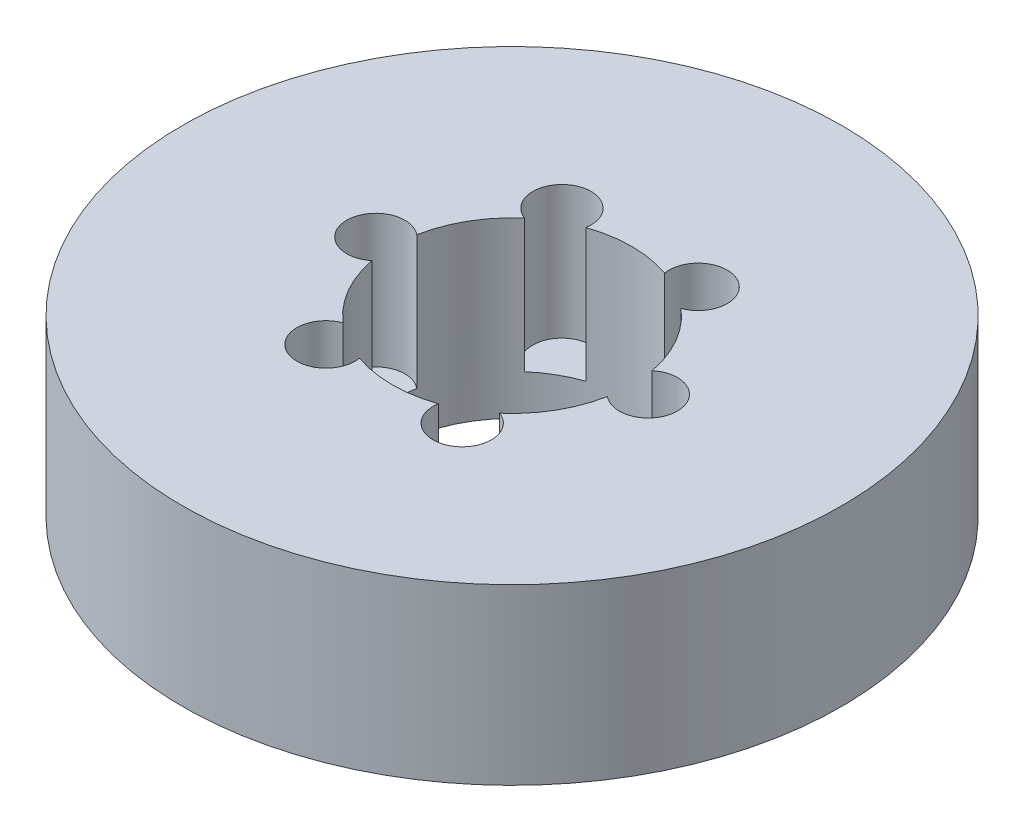
ISO-10303-21;
HEADER;
FILE_DESCRIPTION(('STEP AP214'),'2;1');
FILE_NAME('part.step','',(''),(''),'','','');
FILE_SCHEMA(('AUTOMOTIVE_DESIGN { 1 0 10303 214 1 1 1 1 }'));
ENDSEC;
DATA;
#1=APPLICATION_CONTEXT('core data for automotive mechanical design processes');
#2=APPLICATION_PROTOCOL_DEFINITION('international standard','automotive_design',2000,#1);
#3=PRODUCT_CONTEXT('',#1,'mechanical');
#4=PRODUCT('Part','Part','',(#3));
#5=PRODUCT_RELATED_PRODUCT_CATEGORY('part','',(#4));
#6=PRODUCT_DEFINITION_FORMATION('','',#4);
#7=PRODUCT_DEFINITION_CONTEXT('part definition',#1,'design');
#8=PRODUCT_DEFINITION('design','',#6,#7);
#9=PRODUCT_DEFINITION_SHAPE('','',#8);
#10=(LENGTH_UNIT() NAMED_UNIT(*) SI_UNIT(.MILLI.,.METRE.));
#11=(NAMED_UNIT(*) PLANE_ANGLE_UNIT() SI_UNIT($,.RADIAN.));
#12=(NAMED_UNIT(*) SI_UNIT($,.STERADIAN.) SOLID_ANGLE_UNIT());
#13=UNCERTAINTY_MEASURE_WITH_UNIT(LENGTH_MEASURE(1.E-05),#10,'distance_accuracy_value','');
#14=(GEOMETRIC_REPRESENTATION_CONTEXT(3) GLOBAL_UNCERTAINTY_ASSIGNED_CONTEXT((#13)) GLOBAL_UNIT_ASSIGNED_CONTEXT((#10,
#11,#12)) REPRESENTATION_CONTEXT('',''));
#15=CARTESIAN_POINT('',(0.,0.,0.));
#16=DIRECTION('',(0.,0.,1.));
#17=DIRECTION('',(1.,0.,0.));
#18=AXIS2_PLACEMENT_3D('',#15,#16,#17);
#19=CARTESIAN_POINT('',(0.,29.,0.));
#20=DIRECTION('',(0.,-1.,0.));
#21=DIRECTION('',(0.,0.,-1.));
#22=AXIS2_PLACEMENT_3D('',#19,#20,#21);
#23=CYLINDRICAL_SURFACE('',#22,55.);
#24=CARTESIAN_POINT('',(0.,29.,0.));
#25=DIRECTION('',(0.,1.,0.));
#26=DIRECTION('',(0.,0.,1.));
#27=AXIS2_PLACEMENT_3D('',#24,#25,#26);
#28=CIRCLE('',#27,55.);
#29=CARTESIAN_POINT('',(0.,29.,-55.));
#30=VERTEX_POINT('',#29);
#31=EDGE_CURVE('E171',#30,#30,#28,.T.);
#32=CARTESIAN_POINT('',(0.,0.,0.));
#33=DIRECTION('',(0.,1.,0.));
#34=DIRECTION('',(0.,0.,1.));
#35=AXIS2_PLACEMENT_3D('',#32,#33,#34);
#36=CIRCLE('',#35,55.);
#37=CARTESIAN_POINT('',(0.,0.,-55.));
#38=VERTEX_POINT('',#37);
#39=EDGE_CURVE('E157',#38,#38,#36,.T.);
#40=CARTESIAN_POINT('',(0.,29.,-55.));
#41=CARTESIAN_POINT('',(0.,28.6979166666667,-55.));
#42=CARTESIAN_POINT('',(0.,28.3958333333333,-55.));
#43=CARTESIAN_POINT('',(0.,27.7916666666667,-55.));
#44=CARTESIAN_POINT('',(0.,27.4895833333333,-55.));
#45=CARTESIAN_POINT('',(0.,26.8854166666667,-55.));
#46=CARTESIAN_POINT('',(0.,26.5833333333333,-55.));
#47=CARTESIAN_POINT('',(0.,25.9791666666667,-55.));
#48=CARTESIAN_POINT('',(0.,25.6770833333333,-55.));
#49=CARTESIAN_POINT('',(0.,25.0729166666667,-55.));
#50=CARTESIAN_POINT('',(0.,24.7708333333333,-55.));
#51=CARTESIAN_POINT('',(0.,24.1666666666667,-55.));
#52=CARTESIAN_POINT('',(0.,23.8645833333333,-55.));
#53=CARTESIAN_POINT('',(0.,23.2604166666667,-55.));
#54=CARTESIAN_POINT('',(0.,22.9583333333333,-55.));
#55=CARTESIAN_POINT('',(0.,22.3541666666667,-55.));
#56=CARTESIAN_POINT('',(0.,22.0520833333333,-55.));
#57=CARTESIAN_POINT('',(0.,21.4479166666667,-55.));
#58=CARTESIAN_POINT('',(0.,21.1458333333333,-55.));
#59=CARTESIAN_POINT('',(0.,20.5416666666667,-55.));
#60=CARTESIAN_POINT('',(0.,20.2395833333333,-55.));
#61=CARTESIAN_POINT('',(0.,19.6354166666667,-55.));
#62=CARTESIAN_POINT('',(0.,19.3333333333333,-55.));
#63=CARTESIAN_POINT('',(0.,18.7291666666667,-55.));
#64=CARTESIAN_POINT('',(0.,18.4270833333333,-55.));
#65=CARTESIAN_POINT('',(0.,17.8229166666667,-55.));
#66=CARTESIAN_POINT('',(0.,17.5208333333333,-55.));
#67=CARTESIAN_POINT('',(0.,16.9166666666667,-55.));
#68=CARTESIAN_POINT('',(0.,16.6145833333333,-55.));
#69=CARTESIAN_POINT('',(0.,16.0104166666667,-55.));
#70=CARTESIAN_POINT('',(0.,15.7083333333333,-55.));
#71=CARTESIAN_POINT('',(0.,15.1041666666667,-55.));
#72=CARTESIAN_POINT('',(0.,14.8020833333333,-55.));
#73=CARTESIAN_POINT('',(0.,14.1979166666667,-55.));
#74=CARTESIAN_POINT('',(0.,13.8958333333333,-55.));
#75=CARTESIAN_POINT('',(0.,13.2916666666667,-55.));
#76=CARTESIAN_POINT('',(0.,12.9895833333333,-55.));
#77=CARTESIAN_POINT('',(0.,12.3854166666667,-55.));
#78=CARTESIAN_POINT('',(0.,12.0833333333333,-55.));
#79=CARTESIAN_POINT('',(0.,11.4791666666667,-55.));
#80=CARTESIAN_POINT('',(0.,11.1770833333333,-55.));
#81=CARTESIAN_POINT('',(0.,10.5729166666667,-55.));
#82=CARTESIAN_POINT('',(0.,10.2708333333333,-55.));
#83=CARTESIAN_POINT('',(0.,9.66666666666667,-55.));
#84=CARTESIAN_POINT('',(0.,9.36458333333333,-55.));
#85=CARTESIAN_POINT('',(0.,8.76041666666667,-55.));
#86=CARTESIAN_POINT('',(0.,8.45833333333333,-55.));
#87=CARTESIAN_POINT('',(0.,7.85416666666667,-55.));
#88=CARTESIAN_POINT('',(0.,7.55208333333333,-55.));
#89=CARTESIAN_POINT('',(0.,6.94791666666667,-55.));
#90=CARTESIAN_POINT('',(0.,6.64583333333333,-55.));
#91=CARTESIAN_POINT('',(0.,6.04166666666667,-55.));
#92=CARTESIAN_POINT('',(0.,5.73958333333333,-55.));
#93=CARTESIAN_POINT('',(0.,5.13541666666667,-55.));
#94=CARTESIAN_POINT('',(0.,4.83333333333333,-55.));
#95=CARTESIAN_POINT('',(0.,4.22916666666667,-55.));
#96=CARTESIAN_POINT('',(0.,3.92708333333333,-55.));
#97=CARTESIAN_POINT('',(0.,3.32291666666667,-55.));
#98=CARTESIAN_POINT('',(0.,3.02083333333333,-55.));
#99=CARTESIAN_POINT('',(0.,2.41666666666667,-55.));
#100=CARTESIAN_POINT('',(0.,2.11458333333333,-55.));
#101=CARTESIAN_POINT('',(0.,1.51041666666667,-55.));
#102=CARTESIAN_POINT('',(0.,1.20833333333333,-55.));
#103=CARTESIAN_POINT('',(0.,0.604166666666667,-55.));
#104=CARTESIAN_POINT('',(0.,0.302083333333333,-55.));
#105=CARTESIAN_POINT('',(0.,0.,-55.));
#106=B_SPLINE_CURVE_WITH_KNOTS('',3,(#40,#41,#42,#43,#44,#45,#46,#47,#48,#49,#50,#51,#52,#53,
#54,#55,#56,#57,#58,#59,#60,#61,#62,#63,#64,#65,#66,#67,#68,#69,#70,#71,#72,#73,#74,#75,#76,#77,
#78,#79,#80,#81,#82,#83,#84,#85,#86,#87,#88,#89,#90,#91,#92,#93,#94,#95,#96,#97,#98,#99,#100,
#101,#102,#103,#104,#105),.UNSPECIFIED.,.F.,.F.,(4,2,2,2,2,2,2,2,2,2,2,2,2,2,2,2,2,2,2,2,2,2,2,
2,2,2,2,2,2,2,2,2,4),(0.,0.906250000000001,1.8125,2.71875,3.625,4.53125,5.4375,6.34375,7.25,
8.15625,9.0625,9.96875,10.875,11.78125,12.6875,13.59375,14.5,15.40625,16.3125,17.21875,18.125,
19.03125,19.9375,20.84375,21.75,22.65625,23.5625,24.46875,25.375,26.28125,27.1875,28.09375,29.),.UNSPECIFIED.);
#107=EDGE_CURVE('BSEAM39',#30,#38,#106,.T.);
#108=ORIENTED_EDGE('',*,*,#31,.F.);
#109=ORIENTED_EDGE('',*,*,#39,.T.);
#110=ORIENTED_EDGE('',*,*,#107,.T.);
#111=ORIENTED_EDGE('',*,*,#107,.F.);
#112=EDGE_LOOP('',(#108,#110,#109,#111));
#113=FACE_BOUND('',#112,.T.);
#114=ADVANCED_FACE('F39',(#113),#23,.T.);
#115=CARTESIAN_POINT('',(0.,29.,0.));
#116=DIRECTION('',(0.,1.,0.));
#117=DIRECTION('',(0.,0.,1.));
#118=AXIS2_PLACEMENT_3D('',#115,#116,#117);
#119=PLANE('',#118);
#120=CARTESIAN_POINT('',(-11.3669196082087,29.,-19.6880822869678));
#121=DIRECTION('',(0.,1.,0.));
#122=DIRECTION('',(-0.866025403784433,0.,0.50000000000001));
#123=AXIS2_PLACEMENT_3D('',#120,#121,#122);
#124=CIRCLE('',#123,4.85690628184819);
#125=CARTESIAN_POINT('',(-6.57638975821289,29.,-18.887855827173));
#126=VERTEX_POINT('',#125);
#127=CARTESIAN_POINT('',(-13.0691680902437,29.,-15.1392485093864));
#128=VERTEX_POINT('',#127);
#129=EDGE_CURVE('E214',#126,#128,#124,.T.);
#130=ORIENTED_EDGE('',*,*,#129,.F.);
#131=CARTESIAN_POINT('',(0.,29.,0.));
#132=DIRECTION('',(0.,1.,0.));
#133=DIRECTION('',(0.,0.,1.));
#134=AXIS2_PLACEMENT_3D('',#131,#132,#133);
#135=CIRCLE('',#134,20.);
#136=CARTESIAN_POINT('',(6.57638975821249,29.,-18.8878558271731));
#137=VERTEX_POINT('',#136);
#138=EDGE_CURVE('E272',#137,#126,#135,.T.);
#139=ORIENTED_EDGE('',*,*,#138,.F.);
#140=CARTESIAN_POINT('',(11.3669196082083,29.,-19.688082286968));
#141=DIRECTION('',(0.,1.,0.));
#142=DIRECTION('',(-0.866025403784443,0.,-0.499999999999992));
#143=AXIS2_PLACEMENT_3D('',#140,#141,#142);
#144=CIRCLE('',#143,4.85690628184819);
#145=CARTESIAN_POINT('',(13.0691680902433,29.,-15.1392485093866));
#146=VERTEX_POINT('',#145);
#147=EDGE_CURVE('E285',#146,#137,#144,.T.);
#148=ORIENTED_EDGE('',*,*,#147,.F.);
#149=CARTESIAN_POINT('',(19.6455578484562,29.,-3.74860731778656));
#150=VERTEX_POINT('',#149);
#151=EDGE_CURVE('E165',#150,#146,#135,.T.);
#152=ORIENTED_EDGE('',*,*,#151,.F.);
#153=CARTESIAN_POINT('',(22.7338392164169,29.,0.));
#154=DIRECTION('',(0.,1.,0.));
#155=DIRECTION('',(0.,0.,-1.));
#156=AXIS2_PLACEMENT_3D('',#153,#154,#155);
#157=CIRCLE('',#156,4.85690628184819);
#158=CARTESIAN_POINT('',(19.6455578484562,29.,3.74860731778656));
#159=VERTEX_POINT('',#158);
#160=EDGE_CURVE('E281',#159,#150,#157,.T.);
#161=ORIENTED_EDGE('',*,*,#160,.F.);
#162=CARTESIAN_POINT('',(13.0691680902436,29.,15.1392485093865));
#163=VERTEX_POINT('',#162);
#164=EDGE_CURVE('E160',#163,#159,#135,.T.);
#165=ORIENTED_EDGE('',*,*,#164,.F.);
#166=CARTESIAN_POINT('',(11.3669196082085,29.,19.6880822869679));
#167=DIRECTION('',(0.,1.,0.));
#168=DIRECTION('',(0.866025403784436,0.,-0.500000000000004));
#169=AXIS2_PLACEMENT_3D('',#166,#167,#168);
#170=CIRCLE('',#169,4.85690628184819);
#171=CARTESIAN_POINT('',(6.57638975821276,29.,18.887855827173));
#172=VERTEX_POINT('',#171);
#173=EDGE_CURVE('E154',#172,#163,#170,.T.);
#174=ORIENTED_EDGE('',*,*,#173,.F.);
#175=CARTESIAN_POINT('',(-6.57638975821263,29.,18.8878558271731));
#176=VERTEX_POINT('',#175);
#177=EDGE_CURVE('E150',#176,#172,#135,.T.);
#178=ORIENTED_EDGE('',*,*,#177,.F.);
#179=CARTESIAN_POINT('',(-11.3669196082084,29.,19.688082286968));
#180=DIRECTION('',(0.,1.,0.));
#181=DIRECTION('',(0.86602540378444,0.,0.499999999999998));
#182=AXIS2_PLACEMENT_3D('',#179,#180,#181);
#183=CIRCLE('',#182,4.85690628184819);
#184=CARTESIAN_POINT('',(-13.0691680902434,29.,15.1392485093865));
#185=VERTEX_POINT('',#184);
#186=EDGE_CURVE('E127',#185,#176,#183,.T.);
#187=ORIENTED_EDGE('',*,*,#186,.F.);
#188=CARTESIAN_POINT('',(-19.6455578484562,29.,3.74860731778656));
#189=VERTEX_POINT('',#188);
#190=EDGE_CURVE('E156',#189,#185,#135,.T.);
#191=ORIENTED_EDGE('',*,*,#190,.F.);
#192=CARTESIAN_POINT('',(-22.7338392164169,29.,0.));
#193=DIRECTION('',(0.,1.,0.));
#194=DIRECTION('',(0.,0.,1.));
#195=AXIS2_PLACEMENT_3D('',#192,#193,#194);
#196=CIRCLE('',#195,4.85690628184819);
#197=CARTESIAN_POINT('',(-19.6455578484562,29.,-3.74860731778656));
#198=VERTEX_POINT('',#197);
#199=EDGE_CURVE('E164',#198,#189,#196,.T.);
#200=ORIENTED_EDGE('',*,*,#199,.F.);
#201=EDGE_CURVE('E159',#128,#198,#135,.T.);
#202=ORIENTED_EDGE('',*,*,#201,.F.);
#203=EDGE_LOOP('',(#130,#139,#148,#152,#161,#165,#174,#178,#187,#191,#200,#202));
#204=FACE_BOUND('',#203,.T.);
#205=ORIENTED_EDGE('',*,*,#31,.T.);
#206=EDGE_LOOP('',(#205));
#207=FACE_BOUND('',#206,.T.);
#208=ADVANCED_FACE('F155',(#204,#207),#119,.T.);
#209=CARTESIAN_POINT('',(0.,0.,0.));
#210=DIRECTION('',(0.,1.,0.));
#211=DIRECTION('',(0.,0.,1.));
#212=AXIS2_PLACEMENT_3D('',#209,#210,#211);
#213=PLANE('',#212);
#214=CARTESIAN_POINT('',(0.,0.,0.));
#215=DIRECTION('',(0.,1.,0.));
#216=DIRECTION('',(0.,0.,1.));
#217=AXIS2_PLACEMENT_3D('',#214,#215,#216);
#218=CIRCLE('',#217,20.);
#219=CARTESIAN_POINT('',(0.,0.,20.));
#220=VERTEX_POINT('',#219);
#221=EDGE_CURVE('E170',#220,#220,#218,.T.);
#222=ORIENTED_EDGE('',*,*,#221,.T.);
#223=EDGE_LOOP('',(#222));
#224=FACE_BOUND('',#223,.T.);
#225=ORIENTED_EDGE('',*,*,#39,.F.);
#226=EDGE_LOOP('',(#225));
#227=FACE_BOUND('',#226,.T.);
#228=ADVANCED_FACE('F232',(#224,#227),#213,.F.);
#229=CARTESIAN_POINT('',(0.,29.,0.));
#230=DIRECTION('',(0.,-1.,0.));
#231=DIRECTION('',(0.,0.,-1.));
#232=AXIS2_PLACEMENT_3D('',#229,#230,#231);
#233=CYLINDRICAL_SURFACE('',#232,20.);
#234=DIRECTION('',(0.,1.,0.));
#235=VECTOR('',#234,1.);
#236=CARTESIAN_POINT('',(-6.57638975821289,17.895248681265,-18.887855827173));
#237=LINE('',#236,#235);
#238=CARTESIAN_POINT('',(-6.57638975821289,6.79049736253001,-18.887855827173));
#239=VERTEX_POINT('',#238);
#240=EDGE_CURVE('E11',#239,#126,#237,.T.);
#241=ORIENTED_EDGE('',*,*,#240,.F.);
#242=CARTESIAN_POINT('',(0.,6.79049736253001,0.));
#243=DIRECTION('',(0.,1.,0.));
#244=DIRECTION('',(0.,0.,1.));
#245=AXIS2_PLACEMENT_3D('',#242,#243,#244);
#246=CIRCLE('',#245,20.);
#247=CARTESIAN_POINT('',(-13.0691680902437,6.79049736253001,-15.1392485093864));
#248=VERTEX_POINT('',#247);
#249=EDGE_CURVE('E209',#239,#248,#246,.T.);
#250=ORIENTED_EDGE('',*,*,#249,.T.);
#251=DIRECTION('',(0.,1.,0.));
#252=VECTOR('',#251,1.);
#253=CARTESIAN_POINT('',(-13.0691680902437,17.895248681265,-15.1392485093864));
#254=LINE('',#253,#252);
#255=EDGE_CURVE('E46',#128,#248,#254,.F.);
#256=ORIENTED_EDGE('',*,*,#255,.F.);
#257=ORIENTED_EDGE('',*,*,#201,.T.);
#258=DIRECTION('',(0.,1.,0.));
#259=VECTOR('',#258,1.);
#260=CARTESIAN_POINT('',(-19.6455578484561,17.895248681265,-3.74860731778656));
#261=LINE('',#260,#259);
#262=CARTESIAN_POINT('',(-19.6455578484562,6.79049736253001,-3.74860731778656));
#263=VERTEX_POINT('',#262);
#264=EDGE_CURVE('E185',#263,#198,#261,.T.);
#265=ORIENTED_EDGE('',*,*,#264,.F.);
#266=CARTESIAN_POINT('',(0.,6.79049736253001,0.));
#267=DIRECTION('',(0.,1.,0.));
#268=DIRECTION('',(0.,0.,1.));
#269=AXIS2_PLACEMENT_3D('',#266,#267,#268);
#270=CIRCLE('',#269,20.);
#271=CARTESIAN_POINT('',(-19.6455578484562,6.79049736253001,3.74860731778656));
#272=VERTEX_POINT('',#271);
#273=EDGE_CURVE('E173',#263,#272,#270,.T.);
#274=ORIENTED_EDGE('',*,*,#273,.T.);
#275=DIRECTION('',(0.,1.,0.));
#276=VECTOR('',#275,1.);
#277=CARTESIAN_POINT('',(-19.6455578484561,17.895248681265,3.74860731778656));
#278=LINE('',#277,#276);
#279=EDGE_CURVE('E178',#189,#272,#278,.F.);
#280=ORIENTED_EDGE('',*,*,#279,.F.);
#281=ORIENTED_EDGE('',*,*,#190,.T.);
#282=DIRECTION('',(0.,1.,0.));
#283=VECTOR('',#282,1.);
#284=CARTESIAN_POINT('',(-13.0691680902434,17.895248681265,15.1392485093865));
#285=LINE('',#284,#283);
#286=CARTESIAN_POINT('',(-13.0691680902434,6.79049736253001,15.1392485093865));
#287=VERTEX_POINT('',#286);
#288=EDGE_CURVE('E132',#287,#185,#285,.T.);
#289=ORIENTED_EDGE('',*,*,#288,.F.);
#290=CARTESIAN_POINT('',(0.,6.79049736253001,0.));
#291=DIRECTION('',(0.,1.,0.));
#292=DIRECTION('',(0.,0.,1.));
#293=AXIS2_PLACEMENT_3D('',#290,#291,#292);
#294=CIRCLE('',#293,20.);
#295=CARTESIAN_POINT('',(-6.57638975821263,6.79049736253001,18.8878558271731));
#296=VERTEX_POINT('',#295);
#297=EDGE_CURVE('E146',#287,#296,#294,.T.);
#298=ORIENTED_EDGE('',*,*,#297,.T.);
#299=DIRECTION('',(0.,1.,0.));
#300=VECTOR('',#299,1.);
#301=CARTESIAN_POINT('',(-6.57638975821263,17.895248681265,18.8878558271731));
#302=LINE('',#301,#300);
#303=EDGE_CURVE('E128',#176,#296,#302,.F.);
#304=ORIENTED_EDGE('',*,*,#303,.F.);
#305=ORIENTED_EDGE('',*,*,#177,.T.);
#306=DIRECTION('',(0.,1.,0.));
#307=VECTOR('',#306,1.);
#308=CARTESIAN_POINT('',(6.57638975821276,17.895248681265,18.887855827173));
#309=LINE('',#308,#307);
#310=CARTESIAN_POINT('',(6.57638975821276,6.79049736253001,18.887855827173));
#311=VERTEX_POINT('',#310);
#312=EDGE_CURVE('E192',#311,#172,#309,.T.);
#313=ORIENTED_EDGE('',*,*,#312,.F.);
#314=CARTESIAN_POINT('',(0.,6.79049736253001,0.));
#315=DIRECTION('',(0.,1.,0.));
#316=DIRECTION('',(0.,0.,1.));
#317=AXIS2_PLACEMENT_3D('',#314,#315,#316);
#318=CIRCLE('',#317,20.);
#319=CARTESIAN_POINT('',(13.0691680902436,6.79049736253001,15.1392485093865));
#320=VERTEX_POINT('',#319);
#321=EDGE_CURVE('E190',#311,#320,#318,.T.);
#322=ORIENTED_EDGE('',*,*,#321,.T.);
#323=DIRECTION('',(0.,1.,0.));
#324=VECTOR('',#323,1.);
#325=CARTESIAN_POINT('',(13.0691680902435,17.895248681265,15.1392485093864));
#326=LINE('',#325,#324);
#327=EDGE_CURVE('E189',#163,#320,#326,.F.);
#328=ORIENTED_EDGE('',*,*,#327,.F.);
#329=ORIENTED_EDGE('',*,*,#164,.T.);
#330=DIRECTION('',(0.,1.,0.));
#331=VECTOR('',#330,1.);
#332=CARTESIAN_POINT('',(19.6455578484561,17.895248681265,3.74860731778656));
#333=LINE('',#332,#331);
#334=CARTESIAN_POINT('',(19.6455578484562,6.79049736253001,3.74860731778656));
#335=VERTEX_POINT('',#334);
#336=EDGE_CURVE('E203',#335,#159,#333,.T.);
#337=ORIENTED_EDGE('',*,*,#336,.F.);
#338=CARTESIAN_POINT('',(0.,6.79049736253001,0.));
#339=DIRECTION('',(0.,1.,0.));
#340=DIRECTION('',(0.,0.,1.));
#341=AXIS2_PLACEMENT_3D('',#338,#339,#340);
#342=CIRCLE('',#341,20.);
#343=CARTESIAN_POINT('',(19.6455578484562,6.79049736253001,-3.74860731778656));
#344=VERTEX_POINT('',#343);
#345=EDGE_CURVE('E194',#335,#344,#342,.T.);
#346=ORIENTED_EDGE('',*,*,#345,.T.);
#347=DIRECTION('',(0.,1.,0.));
#348=VECTOR('',#347,1.);
#349=CARTESIAN_POINT('',(19.6455578484561,17.895248681265,-3.74860731778656));
#350=LINE('',#349,#348);
#351=EDGE_CURVE('E196',#150,#344,#350,.F.);
#352=ORIENTED_EDGE('',*,*,#351,.F.);
#353=ORIENTED_EDGE('',*,*,#151,.T.);
#354=DIRECTION('',(0.,1.,0.));
#355=VECTOR('',#354,1.);
#356=CARTESIAN_POINT('',(13.0691680902433,17.895248681265,-15.1392485093866));
#357=LINE('',#356,#355);
#358=CARTESIAN_POINT('',(13.0691680902433,6.79049736253001,-15.1392485093866));
#359=VERTEX_POINT('',#358);
#360=EDGE_CURVE('E208',#359,#146,#357,.T.);
#361=ORIENTED_EDGE('',*,*,#360,.F.);
#362=CARTESIAN_POINT('',(0.,6.79049736253001,0.));
#363=DIRECTION('',(0.,1.,0.));
#364=DIRECTION('',(0.,0.,1.));
#365=AXIS2_PLACEMENT_3D('',#362,#363,#364);
#366=CIRCLE('',#365,20.);
#367=CARTESIAN_POINT('',(6.57638975821249,6.79049736253001,-18.8878558271731));
#368=VERTEX_POINT('',#367);
#369=EDGE_CURVE('E201',#359,#368,#366,.T.);
#370=ORIENTED_EDGE('',*,*,#369,.T.);
#371=DIRECTION('',(0.,1.,0.));
#372=VECTOR('',#371,1.);
#373=CARTESIAN_POINT('',(6.5763897582125,17.895248681265,-18.8878558271731));
#374=LINE('',#373,#372);
#375=EDGE_CURVE('E206',#137,#368,#374,.F.);
#376=ORIENTED_EDGE('',*,*,#375,.F.);
#377=ORIENTED_EDGE('',*,*,#138,.T.);
#378=EDGE_LOOP('',(#241,#250,#256,#257,#265,#274,#280,#281,#289,#298,#304,#305,#313,#322,#328,
#329,#337,#346,#352,#353,#361,#370,#376,#377));
#379=FACE_BOUND('',#378,.T.);
#380=ORIENTED_EDGE('',*,*,#221,.F.);
#381=EDGE_LOOP('',(#380));
#382=FACE_BOUND('',#381,.T.);
#383=ADVANCED_FACE('F145',(#379,#382),#233,.F.);
#384=CARTESIAN_POINT('',(-22.7338392164169,6.79049736253001,0.));
#385=DIRECTION('',(0.,1.,0.));
#386=DIRECTION('',(0.,0.,1.));
#387=AXIS2_PLACEMENT_3D('',#384,#385,#386);
#388=CYLINDRICAL_SURFACE('',#387,4.85690628184819);
#389=ORIENTED_EDGE('',*,*,#264,.T.);
#390=ORIENTED_EDGE('',*,*,#199,.T.);
#391=ORIENTED_EDGE('',*,*,#279,.T.);
#392=CARTESIAN_POINT('',(-22.7338392164169,6.79049736253001,0.));
#393=DIRECTION('',(0.,1.,0.));
#394=DIRECTION('',(0.,0.,1.));
#395=AXIS2_PLACEMENT_3D('',#392,#393,#394);
#396=CIRCLE('',#395,4.85690628184819);
#397=EDGE_CURVE('E168',#263,#272,#396,.T.);
#398=ORIENTED_EDGE('',*,*,#397,.F.);
#399=EDGE_LOOP('',(#389,#390,#391,#398));
#400=FACE_BOUND('',#399,.T.);
#401=ADVANCED_FACE('F243',(#400),#388,.F.);
#402=CARTESIAN_POINT('',(-22.7338392164169,6.79049736253001,0.));
#403=DIRECTION('',(0.,1.,0.));
#404=DIRECTION('',(0.,0.,1.));
#405=AXIS2_PLACEMENT_3D('',#402,#403,#404);
#406=PLANE('',#405);
#407=ORIENTED_EDGE('',*,*,#397,.T.);
#408=ORIENTED_EDGE('',*,*,#273,.F.);
#409=EDGE_LOOP('',(#407,#408));
#410=FACE_BOUND('',#409,.T.);
#411=ADVANCED_FACE('F247',(#410),#406,.T.);
#412=CARTESIAN_POINT('',(-11.3669196082084,6.79049736253001,19.688082286968));
#413=DIRECTION('',(0.,1.,0.));
#414=DIRECTION('',(0.,0.,1.));
#415=AXIS2_PLACEMENT_3D('',#412,#413,#414);
#416=CYLINDRICAL_SURFACE('',#415,4.85690628184819);
#417=ORIENTED_EDGE('',*,*,#288,.T.);
#418=ORIENTED_EDGE('',*,*,#186,.T.);
#419=ORIENTED_EDGE('',*,*,#303,.T.);
#420=CARTESIAN_POINT('',(-11.3669196082084,6.79049736253001,19.688082286968));
#421=DIRECTION('',(0.,1.,0.));
#422=DIRECTION('',(0.86602540378444,0.,0.499999999999998));
#423=AXIS2_PLACEMENT_3D('',#420,#421,#422);
#424=CIRCLE('',#423,4.85690628184819);
#425=EDGE_CURVE('E137',#287,#296,#424,.T.);
#426=ORIENTED_EDGE('',*,*,#425,.F.);
#427=EDGE_LOOP('',(#417,#418,#419,#426));
#428=FACE_BOUND('',#427,.T.);
#429=ADVANCED_FACE('F126',(#428),#416,.F.);
#430=CARTESIAN_POINT('',(-11.3669196082084,6.79049736253001,19.688082286968));
#431=DIRECTION('',(0.,1.,0.));
#432=DIRECTION('',(0.86602540378444,0.,0.499999999999998));
#433=AXIS2_PLACEMENT_3D('',#430,#431,#432);
#434=PLANE('',#433);
#435=ORIENTED_EDGE('',*,*,#425,.T.);
#436=ORIENTED_EDGE('',*,*,#297,.F.);
#437=EDGE_LOOP('',(#435,#436));
#438=FACE_BOUND('',#437,.T.);
#439=ADVANCED_FACE('F254',(#438),#434,.T.);
#440=CARTESIAN_POINT('',(11.3669196082085,6.79049736253001,19.6880822869679));
#441=DIRECTION('',(0.,1.,0.));
#442=DIRECTION('',(0.,0.,1.));
#443=AXIS2_PLACEMENT_3D('',#440,#441,#442);
#444=CYLINDRICAL_SURFACE('',#443,4.85690628184819);
#445=ORIENTED_EDGE('',*,*,#312,.T.);
#446=ORIENTED_EDGE('',*,*,#173,.T.);
#447=ORIENTED_EDGE('',*,*,#327,.T.);
#448=CARTESIAN_POINT('',(11.3669196082085,6.79049736253001,19.6880822869679));
#449=DIRECTION('',(0.,1.,0.));
#450=DIRECTION('',(0.866025403784436,0.,-0.500000000000004));
#451=AXIS2_PLACEMENT_3D('',#448,#449,#450);
#452=CIRCLE('',#451,4.85690628184819);
#453=EDGE_CURVE('E138',#311,#320,#452,.T.);
#454=ORIENTED_EDGE('',*,*,#453,.F.);
#455=EDGE_LOOP('',(#445,#446,#447,#454));
#456=FACE_BOUND('',#455,.T.);
#457=ADVANCED_FACE('F260',(#456),#444,.F.);
#458=CARTESIAN_POINT('',(11.3669196082085,6.79049736253001,19.6880822869679));
#459=DIRECTION('',(0.,1.,0.));
#460=DIRECTION('',(0.866025403784436,0.,-0.500000000000004));
#461=AXIS2_PLACEMENT_3D('',#458,#459,#460);
#462=PLANE('',#461);
#463=ORIENTED_EDGE('',*,*,#453,.T.);
#464=ORIENTED_EDGE('',*,*,#321,.F.);
#465=EDGE_LOOP('',(#463,#464));
#466=FACE_BOUND('',#465,.T.);
#467=ADVANCED_FACE('F265',(#466),#462,.T.);
#468=CARTESIAN_POINT('',(22.7338392164169,6.79049736253001,0.));
#469=DIRECTION('',(0.,1.,0.));
#470=DIRECTION('',(0.,0.,1.));
#471=AXIS2_PLACEMENT_3D('',#468,#469,#470);
#472=CYLINDRICAL_SURFACE('',#471,4.85690628184819);
#473=ORIENTED_EDGE('',*,*,#336,.T.);
#474=ORIENTED_EDGE('',*,*,#160,.T.);
#475=ORIENTED_EDGE('',*,*,#351,.T.);
#476=CARTESIAN_POINT('',(22.7338392164169,6.79049736253001,0.));
#477=DIRECTION('',(0.,1.,0.));
#478=DIRECTION('',(0.,0.,-1.));
#479=AXIS2_PLACEMENT_3D('',#476,#477,#478);
#480=CIRCLE('',#479,4.85690628184819);
#481=EDGE_CURVE('E287',#335,#344,#480,.T.);
#482=ORIENTED_EDGE('',*,*,#481,.F.);
#483=EDGE_LOOP('',(#473,#474,#475,#482));
#484=FACE_BOUND('',#483,.T.);
#485=ADVANCED_FACE('F300',(#484),#472,.F.);
#486=CARTESIAN_POINT('',(22.7338392164169,6.79049736253001,0.));
#487=DIRECTION('',(0.,1.,0.));
#488=DIRECTION('',(0.,0.,-1.));
#489=AXIS2_PLACEMENT_3D('',#486,#487,#488);
#490=PLANE('',#489);
#491=ORIENTED_EDGE('',*,*,#481,.T.);
#492=ORIENTED_EDGE('',*,*,#345,.F.);
#493=EDGE_LOOP('',(#491,#492));
#494=FACE_BOUND('',#493,.T.);
#495=ADVANCED_FACE('F298',(#494),#490,.T.);
#496=CARTESIAN_POINT('',(11.3669196082083,6.79049736253001,-19.688082286968));
#497=DIRECTION('',(0.,1.,0.));
#498=DIRECTION('',(0.,0.,1.));
#499=AXIS2_PLACEMENT_3D('',#496,#497,#498);
#500=CYLINDRICAL_SURFACE('',#499,4.85690628184819);
#501=ORIENTED_EDGE('',*,*,#360,.T.);
#502=ORIENTED_EDGE('',*,*,#147,.T.);
#503=ORIENTED_EDGE('',*,*,#375,.T.);
#504=CARTESIAN_POINT('',(11.3669196082083,6.79049736253001,-19.688082286968));
#505=DIRECTION('',(0.,1.,0.));
#506=DIRECTION('',(-0.866025403784443,0.,-0.499999999999992));
#507=AXIS2_PLACEMENT_3D('',#504,#505,#506);
#508=CIRCLE('',#507,4.85690628184819);
#509=EDGE_CURVE('E56',#359,#368,#508,.T.);
#510=ORIENTED_EDGE('',*,*,#509,.F.);
#511=EDGE_LOOP('',(#501,#502,#503,#510));
#512=FACE_BOUND('',#511,.T.);
#513=ADVANCED_FACE('F301',(#512),#500,.F.);
#514=CARTESIAN_POINT('',(11.3669196082083,6.79049736253001,-19.688082286968));
#515=DIRECTION('',(0.,1.,0.));
#516=DIRECTION('',(-0.866025403784443,0.,-0.499999999999992));
#517=AXIS2_PLACEMENT_3D('',#514,#515,#516);
#518=PLANE('',#517);
#519=ORIENTED_EDGE('',*,*,#509,.T.);
#520=ORIENTED_EDGE('',*,*,#369,.F.);
#521=EDGE_LOOP('',(#519,#520));
#522=FACE_BOUND('',#521,.T.);
#523=ADVANCED_FACE('F221',(#522),#518,.T.);
#524=CARTESIAN_POINT('',(-11.3669196082087,6.79049736253001,-19.6880822869678));
#525=DIRECTION('',(0.,1.,0.));
#526=DIRECTION('',(0.,0.,1.));
#527=AXIS2_PLACEMENT_3D('',#524,#525,#526);
#528=CYLINDRICAL_SURFACE('',#527,4.85690628184819);
#529=ORIENTED_EDGE('',*,*,#240,.T.);
#530=ORIENTED_EDGE('',*,*,#129,.T.);
#531=ORIENTED_EDGE('',*,*,#255,.T.);
#532=CARTESIAN_POINT('',(-11.3669196082087,6.79049736253001,-19.6880822869678));
#533=DIRECTION('',(0.,1.,0.));
#534=DIRECTION('',(-0.866025403784433,0.,0.50000000000001));
#535=AXIS2_PLACEMENT_3D('',#532,#533,#534);
#536=CIRCLE('',#535,4.85690628184819);
#537=EDGE_CURVE('E55',#239,#248,#536,.T.);
#538=ORIENTED_EDGE('',*,*,#537,.F.);
#539=EDGE_LOOP('',(#529,#530,#531,#538));
#540=FACE_BOUND('',#539,.T.);
#541=ADVANCED_FACE('F212',(#540),#528,.F.);
#542=CARTESIAN_POINT('',(-11.3669196082087,6.79049736253001,-19.6880822869678));
#543=DIRECTION('',(0.,1.,0.));
#544=DIRECTION('',(-0.866025403784433,0.,0.50000000000001));
#545=AXIS2_PLACEMENT_3D('',#542,#543,#544);
#546=PLANE('',#545);
#547=ORIENTED_EDGE('',*,*,#537,.T.);
#548=ORIENTED_EDGE('',*,*,#249,.F.);
#549=EDGE_LOOP('',(#547,#548));
#550=FACE_BOUND('',#549,.T.);
#551=ADVANCED_FACE('F217',(#550),#546,.T.);
#552=CLOSED_SHELL('',(#114,#208,#228,#383,#401,#411,#429,#439,#457,#467,#485,#495,#513,#523,
#541,#551));
#553=MANIFOLD_SOLID_BREP('B2',#552);
#554=ADVANCED_BREP_SHAPE_REPRESENTATION('',(#18,#553),#14);
#555=SHAPE_DEFINITION_REPRESENTATION(#9,#554);
ENDSEC;
END-ISO-10303-21;
